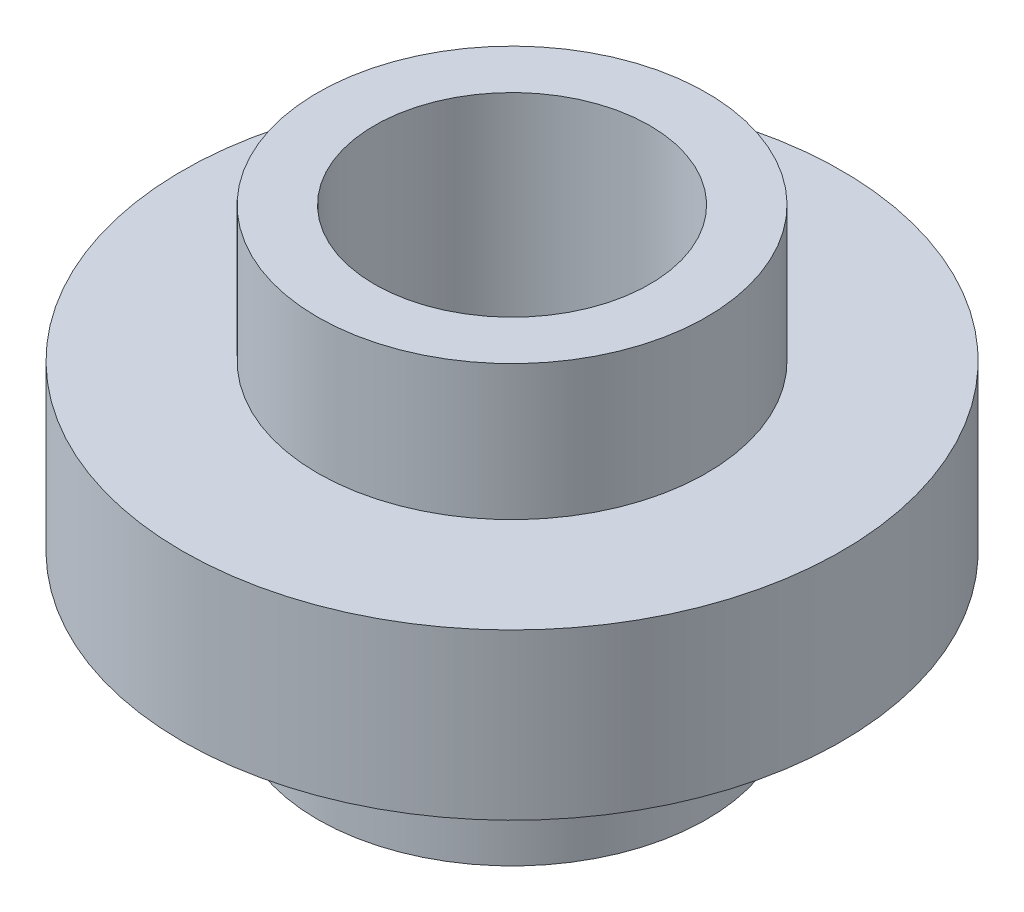
ISO-10303-21;
HEADER;
FILE_DESCRIPTION(('STEP AP214'),'2;1');
FILE_NAME('part.step','',(''),(''),'','','');
FILE_SCHEMA(('AUTOMOTIVE_DESIGN { 1 0 10303 214 1 1 1 1 }'));
ENDSEC;
DATA;
#1=APPLICATION_CONTEXT('core data for automotive mechanical design processes');
#2=APPLICATION_PROTOCOL_DEFINITION('international standard','automotive_design',2000,#1);
#3=PRODUCT_CONTEXT('',#1,'mechanical');
#4=PRODUCT('Part','Part','',(#3));
#5=PRODUCT_RELATED_PRODUCT_CATEGORY('part','',(#4));
#6=PRODUCT_DEFINITION_FORMATION('','',#4);
#7=PRODUCT_DEFINITION_CONTEXT('part definition',#1,'design');
#8=PRODUCT_DEFINITION('design','',#6,#7);
#9=PRODUCT_DEFINITION_SHAPE('','',#8);
#10=(LENGTH_UNIT() NAMED_UNIT(*) SI_UNIT(.MILLI.,.METRE.));
#11=(NAMED_UNIT(*) PLANE_ANGLE_UNIT() SI_UNIT($,.RADIAN.));
#12=(NAMED_UNIT(*) SI_UNIT($,.STERADIAN.) SOLID_ANGLE_UNIT());
#13=UNCERTAINTY_MEASURE_WITH_UNIT(LENGTH_MEASURE(1.E-05),#10,'distance_accuracy_value','');
#14=(GEOMETRIC_REPRESENTATION_CONTEXT(3) GLOBAL_UNCERTAINTY_ASSIGNED_CONTEXT((#13)) GLOBAL_UNIT_ASSIGNED_CONTEXT((#10,
#11,#12)) REPRESENTATION_CONTEXT('',''));
#15=CARTESIAN_POINT('',(0.,0.,0.));
#16=DIRECTION('',(0.,0.,1.));
#17=DIRECTION('',(1.,0.,0.));
#18=AXIS2_PLACEMENT_3D('',#15,#16,#17);
#19=CARTESIAN_POINT('',(0.,6.6,0.));
#20=DIRECTION('',(0.,-1.,0.));
#21=DIRECTION('',(0.,0.,-1.));
#22=AXIS2_PLACEMENT_3D('',#19,#20,#21);
#23=PLANE('',#22);
#24=CARTESIAN_POINT('',(0.,6.6,0.));
#25=DIRECTION('',(0.,1.,0.));
#26=DIRECTION('',(0.,0.,1.));
#27=AXIS2_PLACEMENT_3D('',#24,#25,#26);
#28=CIRCLE('',#27,4.175);
#29=CARTESIAN_POINT('',(0.,6.6,4.175));
#30=VERTEX_POINT('',#29);
#31=EDGE_CURVE('E59',#30,#30,#28,.T.);
#32=ORIENTED_EDGE('',*,*,#31,.F.);
#33=EDGE_LOOP('',(#32));
#34=FACE_BOUND('',#33,.T.);
#35=CARTESIAN_POINT('',(0.,6.6,0.));
#36=DIRECTION('',(0.,1.,0.));
#37=DIRECTION('',(0.,0.,1.));
#38=AXIS2_PLACEMENT_3D('',#35,#36,#37);
#39=CIRCLE('',#38,5.9);
#40=CARTESIAN_POINT('',(0.,6.6,5.90000000000001));
#41=VERTEX_POINT('',#40);
#42=EDGE_CURVE('E10',#41,#41,#39,.T.);
#43=ORIENTED_EDGE('',*,*,#42,.T.);
#44=EDGE_LOOP('',(#43));
#45=FACE_BOUND('',#44,.T.);
#46=ADVANCED_FACE('F33',(#34,#45),#23,.F.);
#47=CARTESIAN_POINT('',(0.,6.6,0.));
#48=DIRECTION('',(0.,1.,0.));
#49=DIRECTION('',(0.,0.,1.));
#50=AXIS2_PLACEMENT_3D('',#47,#48,#49);
#51=CYLINDRICAL_SURFACE('',#50,5.9);
#52=ORIENTED_EDGE('',*,*,#42,.F.);
#53=EDGE_LOOP('',(#52));
#54=FACE_BOUND('',#53,.T.);
#55=CARTESIAN_POINT('',(0.,2.5,0.));
#56=DIRECTION('',(0.,1.,0.));
#57=DIRECTION('',(0.,0.,1.));
#58=AXIS2_PLACEMENT_3D('',#55,#56,#57);
#59=CIRCLE('',#58,5.9);
#60=CARTESIAN_POINT('',(0.,2.5,5.90000000000001));
#61=VERTEX_POINT('',#60);
#62=EDGE_CURVE('E39',#61,#61,#59,.T.);
#63=ORIENTED_EDGE('',*,*,#62,.T.);
#64=EDGE_LOOP('',(#63));
#65=FACE_BOUND('',#64,.T.);
#66=ADVANCED_FACE('F75',(#54,#65),#51,.T.);
#67=CARTESIAN_POINT('',(0.,2.5,-5.9));
#68=DIRECTION('',(0.,-1.,0.));
#69=DIRECTION('',(0.,0.,-1.));
#70=AXIS2_PLACEMENT_3D('',#67,#68,#69);
#71=PLANE('',#70);
#72=ORIENTED_EDGE('',*,*,#62,.F.);
#73=EDGE_LOOP('',(#72));
#74=FACE_BOUND('',#73,.T.);
#75=CARTESIAN_POINT('',(0.,2.5,0.));
#76=DIRECTION('',(0.,1.,0.));
#77=DIRECTION('',(0.,0.,1.));
#78=AXIS2_PLACEMENT_3D('',#75,#76,#77);
#79=CIRCLE('',#78,10.);
#80=CARTESIAN_POINT('',(0.,2.49999999999999,10.));
#81=VERTEX_POINT('',#80);
#82=EDGE_CURVE('E43',#81,#81,#79,.T.);
#83=ORIENTED_EDGE('',*,*,#82,.T.);
#84=EDGE_LOOP('',(#83));
#85=FACE_BOUND('',#84,.T.);
#86=ADVANCED_FACE('F79',(#74,#85),#71,.F.);
#87=CARTESIAN_POINT('',(0.,6.6,0.));
#88=DIRECTION('',(0.,1.,0.));
#89=DIRECTION('',(0.,0.,1.));
#90=AXIS2_PLACEMENT_3D('',#87,#88,#89);
#91=CYLINDRICAL_SURFACE('',#90,10.);
#92=ORIENTED_EDGE('',*,*,#82,.F.);
#93=EDGE_LOOP('',(#92));
#94=FACE_BOUND('',#93,.T.);
#95=CARTESIAN_POINT('',(0.,-2.5,0.));
#96=DIRECTION('',(0.,1.,0.));
#97=DIRECTION('',(0.,0.,1.));
#98=AXIS2_PLACEMENT_3D('',#95,#96,#97);
#99=CIRCLE('',#98,10.);
#100=CARTESIAN_POINT('',(0.,-2.50000000000001,10.));
#101=VERTEX_POINT('',#100);
#102=EDGE_CURVE('E47',#101,#101,#99,.T.);
#103=ORIENTED_EDGE('',*,*,#102,.T.);
#104=EDGE_LOOP('',(#103));
#105=FACE_BOUND('',#104,.T.);
#106=ADVANCED_FACE('F84',(#94,#105),#91,.T.);
#107=CARTESIAN_POINT('',(0.,-2.5,-10.));
#108=DIRECTION('',(0.,1.,0.));
#109=DIRECTION('',(0.,0.,1.));
#110=AXIS2_PLACEMENT_3D('',#107,#108,#109);
#111=PLANE('',#110);
#112=ORIENTED_EDGE('',*,*,#102,.F.);
#113=EDGE_LOOP('',(#112));
#114=FACE_BOUND('',#113,.T.);
#115=CARTESIAN_POINT('',(0.,-2.5,0.));
#116=DIRECTION('',(0.,1.,0.));
#117=DIRECTION('',(0.,0.,1.));
#118=AXIS2_PLACEMENT_3D('',#115,#116,#117);
#119=CIRCLE('',#118,5.9);
#120=CARTESIAN_POINT('',(0.,-2.5,5.9));
#121=VERTEX_POINT('',#120);
#122=EDGE_CURVE('E52',#121,#121,#119,.T.);
#123=ORIENTED_EDGE('',*,*,#122,.T.);
#124=EDGE_LOOP('',(#123));
#125=FACE_BOUND('',#124,.T.);
#126=ADVANCED_FACE('F90',(#114,#125),#111,.F.);
#127=CARTESIAN_POINT('',(0.,6.6,0.));
#128=DIRECTION('',(0.,1.,0.));
#129=DIRECTION('',(0.,0.,1.));
#130=AXIS2_PLACEMENT_3D('',#127,#128,#129);
#131=CYLINDRICAL_SURFACE('',#130,5.9);
#132=ORIENTED_EDGE('',*,*,#122,.F.);
#133=EDGE_LOOP('',(#132));
#134=FACE_BOUND('',#133,.T.);
#135=CARTESIAN_POINT('',(0.,-6.6,0.));
#136=DIRECTION('',(0.,1.,0.));
#137=DIRECTION('',(0.,0.,1.));
#138=AXIS2_PLACEMENT_3D('',#135,#136,#137);
#139=CIRCLE('',#138,5.9);
#140=CARTESIAN_POINT('',(0.,-6.6,5.9));
#141=VERTEX_POINT('',#140);
#142=EDGE_CURVE('E55',#141,#141,#139,.T.);
#143=ORIENTED_EDGE('',*,*,#142,.T.);
#144=EDGE_LOOP('',(#143));
#145=FACE_BOUND('',#144,.T.);
#146=ADVANCED_FACE('F94',(#134,#145),#131,.T.);
#147=CARTESIAN_POINT('',(0.,-6.6,-5.90000000000001));
#148=DIRECTION('',(0.,1.,0.));
#149=DIRECTION('',(0.,0.,1.));
#150=AXIS2_PLACEMENT_3D('',#147,#148,#149);
#151=PLANE('',#150);
#152=CARTESIAN_POINT('',(0.,-6.60000000000001,0.));
#153=DIRECTION('',(0.,1.,0.));
#154=DIRECTION('',(0.,0.,1.));
#155=AXIS2_PLACEMENT_3D('',#152,#153,#154);
#156=CIRCLE('',#155,4.175);
#157=CARTESIAN_POINT('',(0.,-6.60000000000001,4.175));
#158=VERTEX_POINT('',#157);
#159=EDGE_CURVE('E58',#158,#158,#156,.T.);
#160=ORIENTED_EDGE('',*,*,#159,.T.);
#161=EDGE_LOOP('',(#160));
#162=FACE_BOUND('',#161,.T.);
#163=ORIENTED_EDGE('',*,*,#142,.F.);
#164=EDGE_LOOP('',(#163));
#165=FACE_BOUND('',#164,.T.);
#166=ADVANCED_FACE('F65',(#162,#165),#151,.F.);
#167=CARTESIAN_POINT('',(0.,-6.60000000000001,0.));
#168=DIRECTION('',(0.,1.,0.));
#169=DIRECTION('',(0.,0.,1.));
#170=AXIS2_PLACEMENT_3D('',#167,#168,#169);
#171=CYLINDRICAL_SURFACE('',#170,4.175);
#172=ORIENTED_EDGE('',*,*,#159,.F.);
#173=EDGE_LOOP('',(#172));
#174=FACE_BOUND('',#173,.T.);
#175=ORIENTED_EDGE('',*,*,#31,.T.);
#176=EDGE_LOOP('',(#175));
#177=FACE_BOUND('',#176,.T.);
#178=ADVANCED_FACE('F68',(#174,#177),#171,.F.);
#179=CLOSED_SHELL('',(#46,#66,#86,#106,#126,#146,#166,#178));
#180=MANIFOLD_SOLID_BREP('B2',#179);
#181=ADVANCED_BREP_SHAPE_REPRESENTATION('',(#18,#180),#14);
#182=SHAPE_DEFINITION_REPRESENTATION(#9,#181);
ENDSEC;
END-ISO-10303-21;
